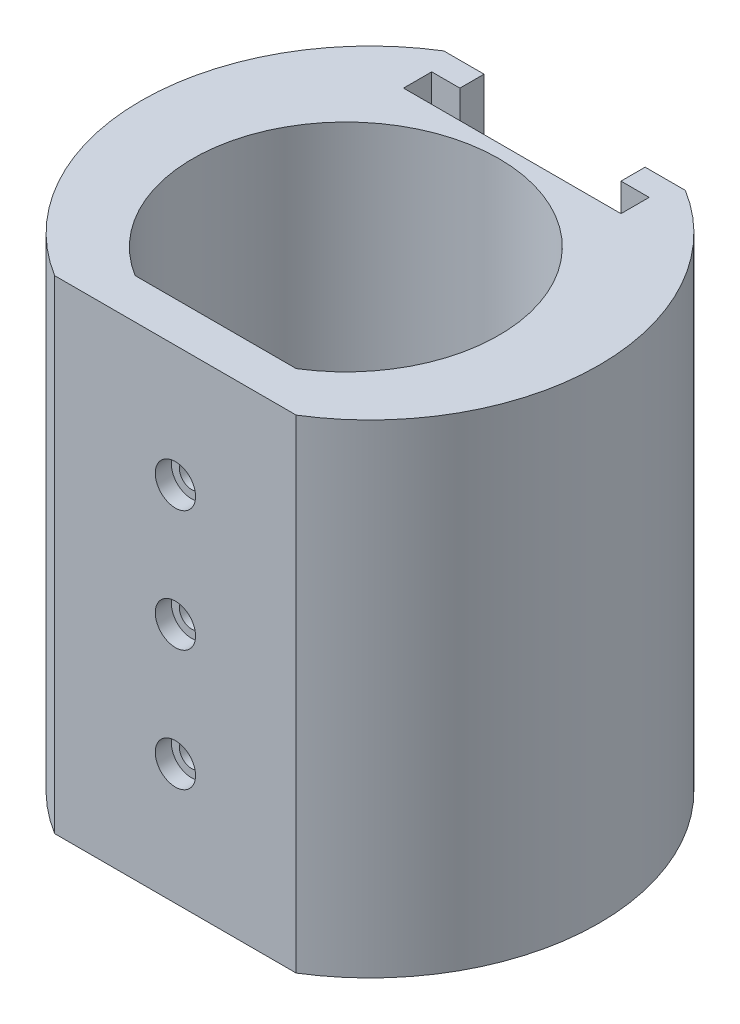
ISO-10303-21;
HEADER;
FILE_DESCRIPTION(('STEP AP214'),'2;1');
FILE_NAME('part.step','',(''),(''),'','','');
FILE_SCHEMA(('AUTOMOTIVE_DESIGN { 1 0 10303 214 1 1 1 1 }'));
ENDSEC;
DATA;
#1=APPLICATION_CONTEXT('core data for automotive mechanical design processes');
#2=APPLICATION_PROTOCOL_DEFINITION('international standard','automotive_design',2000,#1);
#3=PRODUCT_CONTEXT('',#1,'mechanical');
#4=PRODUCT('Part','Part','',(#3));
#5=PRODUCT_RELATED_PRODUCT_CATEGORY('part','',(#4));
#6=PRODUCT_DEFINITION_FORMATION('','',#4);
#7=PRODUCT_DEFINITION_CONTEXT('part definition',#1,'design');
#8=PRODUCT_DEFINITION('design','',#6,#7);
#9=PRODUCT_DEFINITION_SHAPE('','',#8);
#10=(LENGTH_UNIT() NAMED_UNIT(*) SI_UNIT(.MILLI.,.METRE.));
#11=(NAMED_UNIT(*) PLANE_ANGLE_UNIT() SI_UNIT($,.RADIAN.));
#12=(NAMED_UNIT(*) SI_UNIT($,.STERADIAN.) SOLID_ANGLE_UNIT());
#13=UNCERTAINTY_MEASURE_WITH_UNIT(LENGTH_MEASURE(1.E-05),#10,'distance_accuracy_value','');
#14=(GEOMETRIC_REPRESENTATION_CONTEXT(3) GLOBAL_UNCERTAINTY_ASSIGNED_CONTEXT((#13)) GLOBAL_UNIT_ASSIGNED_CONTEXT((#10,
#11,#12)) REPRESENTATION_CONTEXT('',''));
#15=CARTESIAN_POINT('',(0.,0.,0.));
#16=DIRECTION('',(0.,0.,1.));
#17=DIRECTION('',(1.,0.,0.));
#18=AXIS2_PLACEMENT_3D('',#15,#16,#17);
#19=CARTESIAN_POINT('',(0.,15.,19.1613744774385));
#20=DIRECTION('',(0.,0.,1.));
#21=DIRECTION('',(1.,0.,0.));
#22=AXIS2_PLACEMENT_3D('',#19,#20,#21);
#23=PLANE('',#22);
#24=CARTESIAN_POINT('',(0.,15.,19.1613744774385));
#25=DIRECTION('',(0.,0.,1.));
#26=DIRECTION('',(1.,0.,0.));
#27=AXIS2_PLACEMENT_3D('',#24,#25,#26);
#28=CIRCLE('',#27,2.5);
#29=CARTESIAN_POINT('',(2.5,15.,19.1613744774385));
#30=VERTEX_POINT('',#29);
#31=EDGE_CURVE('E211',#30,#30,#28,.T.);
#32=ORIENTED_EDGE('',*,*,#31,.T.);
#33=EDGE_LOOP('',(#32));
#34=FACE_BOUND('',#33,.T.);
#35=CARTESIAN_POINT('',(0.,15.,19.1613744774385));
#36=DIRECTION('',(0.,0.,1.));
#37=DIRECTION('',(1.,0.,0.));
#38=AXIS2_PLACEMENT_3D('',#35,#36,#37);
#39=CIRCLE('',#38,1.5);
#40=CARTESIAN_POINT('',(1.5,15.,19.1613744774385));
#41=VERTEX_POINT('',#40);
#42=EDGE_CURVE('E20',#41,#41,#39,.F.);
#43=ORIENTED_EDGE('',*,*,#42,.T.);
#44=EDGE_LOOP('',(#43));
#45=FACE_BOUND('',#44,.T.);
#46=ADVANCED_FACE('F17',(#34,#45),#23,.T.);
#47=CARTESIAN_POINT('',(0.,-15.,19.1613744774385));
#48=DIRECTION('',(0.,0.,1.));
#49=DIRECTION('',(1.,0.,0.));
#50=AXIS2_PLACEMENT_3D('',#47,#48,#49);
#51=PLANE('',#50);
#52=CARTESIAN_POINT('',(0.,-15.,19.1613744774385));
#53=DIRECTION('',(0.,0.,1.));
#54=DIRECTION('',(1.,0.,0.));
#55=AXIS2_PLACEMENT_3D('',#52,#53,#54);
#56=CIRCLE('',#55,2.5);
#57=CARTESIAN_POINT('',(2.5,-15.,19.1613744774385));
#58=VERTEX_POINT('',#57);
#59=EDGE_CURVE('E208',#58,#58,#56,.T.);
#60=ORIENTED_EDGE('',*,*,#59,.T.);
#61=EDGE_LOOP('',(#60));
#62=FACE_BOUND('',#61,.T.);
#63=CARTESIAN_POINT('',(0.,-15.,19.1613744774385));
#64=DIRECTION('',(0.,0.,1.));
#65=DIRECTION('',(1.,0.,0.));
#66=AXIS2_PLACEMENT_3D('',#63,#64,#65);
#67=CIRCLE('',#66,1.5);
#68=CARTESIAN_POINT('',(1.5,-15.,19.1613744774385));
#69=VERTEX_POINT('',#68);
#70=EDGE_CURVE('E216',#69,#69,#67,.F.);
#71=ORIENTED_EDGE('',*,*,#70,.T.);
#72=EDGE_LOOP('',(#71));
#73=FACE_BOUND('',#72,.T.);
#74=ADVANCED_FACE('F421',(#62,#73),#51,.T.);
#75=CARTESIAN_POINT('',(0.,0.,19.1613744774385));
#76=DIRECTION('',(0.,0.,1.));
#77=DIRECTION('',(1.,0.,0.));
#78=AXIS2_PLACEMENT_3D('',#75,#76,#77);
#79=PLANE('',#78);
#80=CARTESIAN_POINT('',(0.,0.,19.1613744774385));
#81=DIRECTION('',(0.,0.,1.));
#82=DIRECTION('',(1.,0.,0.));
#83=AXIS2_PLACEMENT_3D('',#80,#81,#82);
#84=CIRCLE('',#83,2.5);
#85=CARTESIAN_POINT('',(2.5,0.,19.1613744774385));
#86=VERTEX_POINT('',#85);
#87=EDGE_CURVE('E205',#86,#86,#84,.T.);
#88=ORIENTED_EDGE('',*,*,#87,.T.);
#89=EDGE_LOOP('',(#88));
#90=FACE_BOUND('',#89,.T.);
#91=CARTESIAN_POINT('',(0.,0.,19.1613744774385));
#92=DIRECTION('',(0.,0.,1.));
#93=DIRECTION('',(1.,0.,0.));
#94=AXIS2_PLACEMENT_3D('',#91,#92,#93);
#95=CIRCLE('',#94,1.5);
#96=CARTESIAN_POINT('',(1.5,0.,19.1613744774385));
#97=VERTEX_POINT('',#96);
#98=EDGE_CURVE('E214',#97,#97,#95,.F.);
#99=ORIENTED_EDGE('',*,*,#98,.T.);
#100=EDGE_LOOP('',(#99));
#101=FACE_BOUND('',#100,.T.);
#102=ADVANCED_FACE('F228',(#90,#101),#79,.T.);
#103=CARTESIAN_POINT('',(0.,15.,11.9187337903192));
#104=DIRECTION('',(0.,0.,1.));
#105=DIRECTION('',(1.,0.,0.));
#106=AXIS2_PLACEMENT_3D('',#103,#104,#105);
#107=CYLINDRICAL_SURFACE('',#106,1.5);
#108=ORIENTED_EDGE('',*,*,#42,.F.);
#109=EDGE_LOOP('',(#108));
#110=FACE_BOUND('',#109,.T.);
#111=CARTESIAN_POINT('',(0.,15.,16.1613744774385));
#112=DIRECTION('',(0.,0.,1.));
#113=DIRECTION('',(1.,0.,0.));
#114=AXIS2_PLACEMENT_3D('',#111,#112,#113);
#115=CIRCLE('',#114,1.5);
#116=CARTESIAN_POINT('',(1.5,15.,16.1613744774385));
#117=VERTEX_POINT('',#116);
#118=EDGE_CURVE('E201',#117,#117,#115,.T.);
#119=ORIENTED_EDGE('',*,*,#118,.F.);
#120=EDGE_LOOP('',(#119));
#121=FACE_BOUND('',#120,.T.);
#122=ADVANCED_FACE('F224',(#110,#121),#107,.F.);
#123=CARTESIAN_POINT('',(0.,-15.,11.9187337903192));
#124=DIRECTION('',(0.,0.,1.));
#125=DIRECTION('',(1.,0.,0.));
#126=AXIS2_PLACEMENT_3D('',#123,#124,#125);
#127=CYLINDRICAL_SURFACE('',#126,1.5);
#128=ORIENTED_EDGE('',*,*,#70,.F.);
#129=EDGE_LOOP('',(#128));
#130=FACE_BOUND('',#129,.T.);
#131=CARTESIAN_POINT('',(0.,-15.,16.1613744774385));
#132=DIRECTION('',(0.,0.,1.));
#133=DIRECTION('',(1.,0.,0.));
#134=AXIS2_PLACEMENT_3D('',#131,#132,#133);
#135=CIRCLE('',#134,1.5);
#136=CARTESIAN_POINT('',(1.5,-15.,16.1613744774385));
#137=VERTEX_POINT('',#136);
#138=EDGE_CURVE('E198',#137,#137,#135,.T.);
#139=ORIENTED_EDGE('',*,*,#138,.F.);
#140=EDGE_LOOP('',(#139));
#141=FACE_BOUND('',#140,.T.);
#142=ADVANCED_FACE('F227',(#130,#141),#127,.F.);
#143=CARTESIAN_POINT('',(0.,0.,11.9187337903192));
#144=DIRECTION('',(0.,0.,1.));
#145=DIRECTION('',(1.,0.,0.));
#146=AXIS2_PLACEMENT_3D('',#143,#144,#145);
#147=CYLINDRICAL_SURFACE('',#146,1.5);
#148=ORIENTED_EDGE('',*,*,#98,.F.);
#149=EDGE_LOOP('',(#148));
#150=FACE_BOUND('',#149,.T.);
#151=CARTESIAN_POINT('',(0.,0.,16.1613744774385));
#152=DIRECTION('',(0.,0.,1.));
#153=DIRECTION('',(1.,0.,0.));
#154=AXIS2_PLACEMENT_3D('',#151,#152,#153);
#155=CIRCLE('',#154,1.5);
#156=CARTESIAN_POINT('',(1.5,0.,16.1613744774385));
#157=VERTEX_POINT('',#156);
#158=EDGE_CURVE('E194',#157,#157,#155,.T.);
#159=ORIENTED_EDGE('',*,*,#158,.F.);
#160=EDGE_LOOP('',(#159));
#161=FACE_BOUND('',#160,.T.);
#162=ADVANCED_FACE('F412',(#150,#161),#147,.F.);
#163=CARTESIAN_POINT('',(0.,15.,19.1613744774385));
#164=DIRECTION('',(0.,0.,1.));
#165=DIRECTION('',(1.,0.,0.));
#166=AXIS2_PLACEMENT_3D('',#163,#164,#165);
#167=CYLINDRICAL_SURFACE('',#166,2.5);
#168=ORIENTED_EDGE('',*,*,#31,.F.);
#169=EDGE_LOOP('',(#168));
#170=FACE_BOUND('',#169,.T.);
#171=CARTESIAN_POINT('',(0.,15.,21.1613744774385));
#172=DIRECTION('',(0.,0.,1.));
#173=DIRECTION('',(1.,0.,0.));
#174=AXIS2_PLACEMENT_3D('',#171,#172,#173);
#175=CIRCLE('',#174,2.5);
#176=CARTESIAN_POINT('',(2.5,15.,21.1613744774385));
#177=VERTEX_POINT('',#176);
#178=EDGE_CURVE('E186',#177,#177,#175,.T.);
#179=ORIENTED_EDGE('',*,*,#178,.T.);
#180=EDGE_LOOP('',(#179));
#181=FACE_BOUND('',#180,.T.);
#182=ADVANCED_FACE('F408',(#170,#181),#167,.F.);
#183=CARTESIAN_POINT('',(0.,-15.,19.1613744774385));
#184=DIRECTION('',(0.,0.,1.));
#185=DIRECTION('',(1.,0.,0.));
#186=AXIS2_PLACEMENT_3D('',#183,#184,#185);
#187=CYLINDRICAL_SURFACE('',#186,2.5);
#188=ORIENTED_EDGE('',*,*,#59,.F.);
#189=EDGE_LOOP('',(#188));
#190=FACE_BOUND('',#189,.T.);
#191=CARTESIAN_POINT('',(0.,-15.,21.1613744774385));
#192=DIRECTION('',(0.,0.,1.));
#193=DIRECTION('',(1.,0.,0.));
#194=AXIS2_PLACEMENT_3D('',#191,#192,#193);
#195=CIRCLE('',#194,2.5);
#196=CARTESIAN_POINT('',(2.5,-15.,21.1613744774385));
#197=VERTEX_POINT('',#196);
#198=EDGE_CURVE('E183',#197,#197,#195,.T.);
#199=ORIENTED_EDGE('',*,*,#198,.T.);
#200=EDGE_LOOP('',(#199));
#201=FACE_BOUND('',#200,.T.);
#202=ADVANCED_FACE('F404',(#190,#201),#187,.F.);
#203=CARTESIAN_POINT('',(0.,0.,19.1613744774385));
#204=DIRECTION('',(0.,0.,1.));
#205=DIRECTION('',(1.,0.,0.));
#206=AXIS2_PLACEMENT_3D('',#203,#204,#205);
#207=CYLINDRICAL_SURFACE('',#206,2.5);
#208=ORIENTED_EDGE('',*,*,#87,.F.);
#209=EDGE_LOOP('',(#208));
#210=FACE_BOUND('',#209,.T.);
#211=CARTESIAN_POINT('',(0.,0.,21.1613744774385));
#212=DIRECTION('',(0.,0.,1.));
#213=DIRECTION('',(1.,0.,0.));
#214=AXIS2_PLACEMENT_3D('',#211,#212,#213);
#215=CIRCLE('',#214,2.5);
#216=CARTESIAN_POINT('',(2.5,0.,21.1613744774385));
#217=VERTEX_POINT('',#216);
#218=EDGE_CURVE('E180',#217,#217,#215,.T.);
#219=ORIENTED_EDGE('',*,*,#218,.T.);
#220=EDGE_LOOP('',(#219));
#221=FACE_BOUND('',#220,.T.);
#222=ADVANCED_FACE('F398',(#210,#221),#207,.F.);
#223=CARTESIAN_POINT('',(13.5,-57.7713881539976,-24.1613744774385));
#224=DIRECTION('',(0.,0.,-1.));
#225=DIRECTION('',(-1.,0.,0.));
#226=AXIS2_PLACEMENT_3D('',#223,#224,#225);
#227=PLANE('',#226);
#228=DIRECTION('',(0.,1.,0.));
#229=VECTOR('',#228,1.);
#230=CARTESIAN_POINT('',(13.5,-57.7713881539976,-24.1613744774385));
#231=LINE('',#230,#229);
#232=CARTESIAN_POINT('',(13.5,-20.,-24.1613744774385));
#233=VERTEX_POINT('',#232);
#234=CARTESIAN_POINT('',(13.5,30.,-24.1613744774385));
#235=VERTEX_POINT('',#234);
#236=EDGE_CURVE('E118',#233,#235,#231,.T.);
#237=ORIENTED_EDGE('',*,*,#236,.T.);
#238=DIRECTION('',(1.,0.,0.));
#239=VECTOR('',#238,1.);
#240=CARTESIAN_POINT('',(0.,30.,-24.1613744774385));
#241=LINE('',#240,#239);
#242=CARTESIAN_POINT('',(10.,30.,-24.1613744774385));
#243=VERTEX_POINT('',#242);
#244=EDGE_CURVE('E126',#243,#235,#241,.T.);
#245=ORIENTED_EDGE('',*,*,#244,.F.);
#246=DIRECTION('',(0.,1.,0.));
#247=VECTOR('',#246,1.);
#248=CARTESIAN_POINT('',(10.,-57.7713881539976,-24.1613744774385));
#249=LINE('',#248,#247);
#250=CARTESIAN_POINT('',(10.,-20.,-24.1613744774385));
#251=VERTEX_POINT('',#250);
#252=EDGE_CURVE('E84',#243,#251,#249,.F.);
#253=ORIENTED_EDGE('',*,*,#252,.T.);
#254=DIRECTION('',(1.,0.,0.));
#255=VECTOR('',#254,1.);
#256=CARTESIAN_POINT('',(0.,-20.,-24.1613744774385));
#257=LINE('',#256,#255);
#258=EDGE_CURVE('E123',#233,#251,#257,.F.);
#259=ORIENTED_EDGE('',*,*,#258,.F.);
#260=EDGE_LOOP('',(#237,#245,#253,#259));
#261=FACE_BOUND('',#260,.T.);
#262=ADVANCED_FACE('F121',(#261),#227,.F.);
#263=CARTESIAN_POINT('',(13.5,-57.7713881539976,-20.6613744774385));
#264=DIRECTION('',(1.,0.,0.));
#265=DIRECTION('',(0.,0.,-1.));
#266=AXIS2_PLACEMENT_3D('',#263,#264,#265);
#267=PLANE('',#266);
#268=DIRECTION('',(0.,1.,0.));
#269=VECTOR('',#268,1.);
#270=CARTESIAN_POINT('',(13.5,-57.7713881539976,-20.6613744774385));
#271=LINE('',#270,#269);
#272=CARTESIAN_POINT('',(13.5,-20.,-20.6613744774385));
#273=VERTEX_POINT('',#272);
#274=CARTESIAN_POINT('',(13.5,30.,-20.6613744774385));
#275=VERTEX_POINT('',#274);
#276=EDGE_CURVE('E356',#273,#275,#271,.T.);
#277=ORIENTED_EDGE('',*,*,#276,.T.);
#278=DIRECTION('',(0.,0.,1.));
#279=VECTOR('',#278,1.);
#280=CARTESIAN_POINT('',(13.5,30.,-3.));
#281=LINE('',#280,#279);
#282=EDGE_CURVE('E361',#235,#275,#281,.T.);
#283=ORIENTED_EDGE('',*,*,#282,.F.);
#284=ORIENTED_EDGE('',*,*,#236,.F.);
#285=DIRECTION('',(0.,0.,1.));
#286=VECTOR('',#285,1.);
#287=CARTESIAN_POINT('',(13.5,-20.,-3.));
#288=LINE('',#287,#286);
#289=EDGE_CURVE('E144',#273,#233,#288,.F.);
#290=ORIENTED_EDGE('',*,*,#289,.F.);
#291=EDGE_LOOP('',(#277,#283,#284,#290));
#292=FACE_BOUND('',#291,.T.);
#293=ADVANCED_FACE('F390',(#292),#267,.F.);
#294=CARTESIAN_POINT('',(-13.5,-57.7713881539976,-20.6613744774385));
#295=DIRECTION('',(0.,0.,1.));
#296=DIRECTION('',(1.,0.,0.));
#297=AXIS2_PLACEMENT_3D('',#294,#295,#296);
#298=PLANE('',#297);
#299=DIRECTION('',(0.,1.,0.));
#300=VECTOR('',#299,1.);
#301=CARTESIAN_POINT('',(-13.5,-57.7713881539976,-20.6613744774385));
#302=LINE('',#301,#300);
#303=CARTESIAN_POINT('',(-13.5,-20.,-20.6613744774385));
#304=VERTEX_POINT('',#303);
#305=CARTESIAN_POINT('',(-13.5,30.,-20.6613744774385));
#306=VERTEX_POINT('',#305);
#307=EDGE_CURVE('E348',#304,#306,#302,.T.);
#308=ORIENTED_EDGE('',*,*,#307,.T.);
#309=DIRECTION('',(1.,0.,0.));
#310=VECTOR('',#309,1.);
#311=CARTESIAN_POINT('',(0.,30.,-20.6613744774385));
#312=LINE('',#311,#310);
#313=EDGE_CURVE('E352',#275,#306,#312,.F.);
#314=ORIENTED_EDGE('',*,*,#313,.F.);
#315=ORIENTED_EDGE('',*,*,#276,.F.);
#316=DIRECTION('',(1.,0.,0.));
#317=VECTOR('',#316,1.);
#318=CARTESIAN_POINT('',(0.,-20.,-20.6613744774385));
#319=LINE('',#318,#317);
#320=EDGE_CURVE('E146',#304,#273,#319,.T.);
#321=ORIENTED_EDGE('',*,*,#320,.F.);
#322=EDGE_LOOP('',(#308,#314,#315,#321));
#323=FACE_BOUND('',#322,.T.);
#324=ADVANCED_FACE('F389',(#323),#298,.F.);
#325=CARTESIAN_POINT('',(-13.5,-57.7713881539976,-24.1613744774385));
#326=DIRECTION('',(-1.,0.,0.));
#327=DIRECTION('',(0.,0.,1.));
#328=AXIS2_PLACEMENT_3D('',#325,#326,#327);
#329=PLANE('',#328);
#330=DIRECTION('',(0.,1.,0.));
#331=VECTOR('',#330,1.);
#332=CARTESIAN_POINT('',(-13.5,-57.7713881539976,-24.1613744774385));
#333=LINE('',#332,#331);
#334=CARTESIAN_POINT('',(-13.5,-20.,-24.1613744774385));
#335=VERTEX_POINT('',#334);
#336=CARTESIAN_POINT('',(-13.5,30.,-24.1613744774385));
#337=VERTEX_POINT('',#336);
#338=EDGE_CURVE('E204',#335,#337,#333,.T.);
#339=ORIENTED_EDGE('',*,*,#338,.T.);
#340=DIRECTION('',(0.,0.,1.));
#341=VECTOR('',#340,1.);
#342=CARTESIAN_POINT('',(-13.5,30.,-3.));
#343=LINE('',#342,#341);
#344=EDGE_CURVE('E344',#306,#337,#343,.F.);
#345=ORIENTED_EDGE('',*,*,#344,.F.);
#346=ORIENTED_EDGE('',*,*,#307,.F.);
#347=DIRECTION('',(0.,0.,1.));
#348=VECTOR('',#347,1.);
#349=CARTESIAN_POINT('',(-13.5,-20.,-3.));
#350=LINE('',#349,#348);
#351=EDGE_CURVE('E153',#335,#304,#350,.T.);
#352=ORIENTED_EDGE('',*,*,#351,.F.);
#353=EDGE_LOOP('',(#339,#345,#346,#352));
#354=FACE_BOUND('',#353,.T.);
#355=ADVANCED_FACE('F246',(#354),#329,.F.);
#356=CARTESIAN_POINT('',(-10.,-57.7713881539976,-24.1613744774385));
#357=DIRECTION('',(0.,0.,-1.));
#358=DIRECTION('',(-1.,0.,0.));
#359=AXIS2_PLACEMENT_3D('',#356,#357,#358);
#360=PLANE('',#359);
#361=DIRECTION('',(0.,1.,0.));
#362=VECTOR('',#361,1.);
#363=CARTESIAN_POINT('',(-10.,-57.7713881539976,-24.1613744774385));
#364=LINE('',#363,#362);
#365=CARTESIAN_POINT('',(-10.,-20.,-24.1613744774385));
#366=VERTEX_POINT('',#365);
#367=CARTESIAN_POINT('',(-10.,30.,-24.1613744774385));
#368=VERTEX_POINT('',#367);
#369=EDGE_CURVE('E129',#366,#368,#364,.T.);
#370=ORIENTED_EDGE('',*,*,#369,.T.);
#371=DIRECTION('',(1.,0.,0.));
#372=VECTOR('',#371,1.);
#373=CARTESIAN_POINT('',(0.,30.,-24.1613744774385));
#374=LINE('',#373,#372);
#375=EDGE_CURVE('E296',#337,#368,#374,.T.);
#376=ORIENTED_EDGE('',*,*,#375,.F.);
#377=ORIENTED_EDGE('',*,*,#338,.F.);
#378=DIRECTION('',(1.,0.,0.));
#379=VECTOR('',#378,1.);
#380=CARTESIAN_POINT('',(0.,-20.,-24.1613744774385));
#381=LINE('',#380,#379);
#382=EDGE_CURVE('E156',#366,#335,#381,.F.);
#383=ORIENTED_EDGE('',*,*,#382,.F.);
#384=EDGE_LOOP('',(#370,#376,#377,#383));
#385=FACE_BOUND('',#384,.T.);
#386=ADVANCED_FACE('F235',(#385),#360,.F.);
#387=CARTESIAN_POINT('',(-10.,30.,16.1613744774385));
#388=DIRECTION('',(0.,0.,-1.));
#389=DIRECTION('',(-1.,0.,0.));
#390=AXIS2_PLACEMENT_3D('',#387,#388,#389);
#391=PLANE('',#390);
#392=DIRECTION('',(1.,0.,0.));
#393=VECTOR('',#392,1.);
#394=CARTESIAN_POINT('',(0.,30.,16.1613744774385));
#395=LINE('',#394,#393);
#396=CARTESIAN_POINT('',(10.,30.,16.1613744774385));
#397=VERTEX_POINT('',#396);
#398=CARTESIAN_POINT('',(-10.,30.,16.1613744774385));
#399=VERTEX_POINT('',#398);
#400=EDGE_CURVE('E175',#397,#399,#395,.F.);
#401=ORIENTED_EDGE('',*,*,#400,.F.);
#402=DIRECTION('',(0.,-1.,0.));
#403=VECTOR('',#402,1.);
#404=CARTESIAN_POINT('',(10.,30.,16.1613744774385));
#405=LINE('',#404,#403);
#406=CARTESIAN_POINT('',(10.,-30.,16.1613744774385));
#407=VERTEX_POINT('',#406);
#408=EDGE_CURVE('E335',#397,#407,#405,.T.);
#409=ORIENTED_EDGE('',*,*,#408,.T.);
#410=DIRECTION('',(1.,0.,0.));
#411=VECTOR('',#410,1.);
#412=CARTESIAN_POINT('',(0.,-30.,16.1613744774385));
#413=LINE('',#412,#411);
#414=CARTESIAN_POINT('',(-10.,-30.,16.1613744774385));
#415=VERTEX_POINT('',#414);
#416=EDGE_CURVE('E192',#407,#415,#413,.F.);
#417=ORIENTED_EDGE('',*,*,#416,.T.);
#418=DIRECTION('',(0.,-1.,0.));
#419=VECTOR('',#418,1.);
#420=CARTESIAN_POINT('',(-10.,30.,16.1613744774385));
#421=LINE('',#420,#419);
#422=EDGE_CURVE('E197',#415,#399,#421,.F.);
#423=ORIENTED_EDGE('',*,*,#422,.T.);
#424=EDGE_LOOP('',(#401,#409,#417,#423));
#425=FACE_BOUND('',#424,.T.);
#426=ORIENTED_EDGE('',*,*,#158,.T.);
#427=EDGE_LOOP('',(#426));
#428=FACE_BOUND('',#427,.T.);
#429=ORIENTED_EDGE('',*,*,#138,.T.);
#430=EDGE_LOOP('',(#429));
#431=FACE_BOUND('',#430,.T.);
#432=ORIENTED_EDGE('',*,*,#118,.T.);
#433=EDGE_LOOP('',(#432));
#434=FACE_BOUND('',#433,.T.);
#435=ADVANCED_FACE('F232',(#425,#428,#431,#434),#391,.T.);
#436=CARTESIAN_POINT('',(0.,30.,0.));
#437=DIRECTION('',(0.,-1.,0.));
#438=DIRECTION('',(0.,0.,-1.));
#439=AXIS2_PLACEMENT_3D('',#436,#437,#438);
#440=CYLINDRICAL_SURFACE('',#439,19.005);
#441=CARTESIAN_POINT('',(0.,30.,0.));
#442=DIRECTION('',(0.,-1.,0.));
#443=DIRECTION('',(0.,0.,-1.));
#444=AXIS2_PLACEMENT_3D('',#441,#442,#443);
#445=CIRCLE('',#444,19.005);
#446=EDGE_CURVE('E171',#399,#397,#445,.T.);
#447=ORIENTED_EDGE('',*,*,#446,.F.);
#448=ORIENTED_EDGE('',*,*,#422,.F.);
#449=CARTESIAN_POINT('',(0.,-30.,0.));
#450=DIRECTION('',(0.,-1.,0.));
#451=DIRECTION('',(0.,0.,-1.));
#452=AXIS2_PLACEMENT_3D('',#449,#450,#451);
#453=CIRCLE('',#452,19.005);
#454=EDGE_CURVE('E189',#415,#407,#453,.T.);
#455=ORIENTED_EDGE('',*,*,#454,.T.);
#456=ORIENTED_EDGE('',*,*,#408,.F.);
#457=EDGE_LOOP('',(#447,#448,#455,#456));
#458=FACE_BOUND('',#457,.T.);
#459=ADVANCED_FACE('F234',(#458),#440,.F.);
#460=CARTESIAN_POINT('',(-10.,-57.7713881539976,-27.1613744774385));
#461=DIRECTION('',(-1.,0.,0.));
#462=DIRECTION('',(0.,0.,1.));
#463=AXIS2_PLACEMENT_3D('',#460,#461,#462);
#464=PLANE('',#463);
#465=DIRECTION('',(0.,1.,0.));
#466=VECTOR('',#465,1.);
#467=CARTESIAN_POINT('',(-10.,30.,-27.1613744774385));
#468=LINE('',#467,#466);
#469=CARTESIAN_POINT('',(-10.,-20.,-27.1613744774385));
#470=VERTEX_POINT('',#469);
#471=CARTESIAN_POINT('',(-10.,30.,-27.1613744774385));
#472=VERTEX_POINT('',#471);
#473=EDGE_CURVE('E174',#470,#472,#468,.T.);
#474=ORIENTED_EDGE('',*,*,#473,.T.);
#475=DIRECTION('',(0.,0.,1.));
#476=VECTOR('',#475,1.);
#477=CARTESIAN_POINT('',(-10.,30.,-3.));
#478=LINE('',#477,#476);
#479=EDGE_CURVE('E289',#368,#472,#478,.F.);
#480=ORIENTED_EDGE('',*,*,#479,.F.);
#481=ORIENTED_EDGE('',*,*,#369,.F.);
#482=DIRECTION('',(0.,0.,1.));
#483=VECTOR('',#482,1.);
#484=CARTESIAN_POINT('',(-10.,-20.,-3.));
#485=LINE('',#484,#483);
#486=EDGE_CURVE('E128',#470,#366,#485,.T.);
#487=ORIENTED_EDGE('',*,*,#486,.F.);
#488=EDGE_LOOP('',(#474,#480,#481,#487));
#489=FACE_BOUND('',#488,.T.);
#490=ADVANCED_FACE('F243',(#489),#464,.F.);
#491=CARTESIAN_POINT('',(0.,30.,-3.));
#492=DIRECTION('',(0.,-1.,0.));
#493=DIRECTION('',(0.,0.,-1.));
#494=AXIS2_PLACEMENT_3D('',#491,#492,#493);
#495=CYLINDRICAL_SURFACE('',#494,28.4389172902032);
#496=CARTESIAN_POINT('',(0.,30.,-3.));
#497=DIRECTION('',(0.,-1.,0.));
#498=DIRECTION('',(0.,0.,-1.));
#499=AXIS2_PLACEMENT_3D('',#496,#497,#498);
#500=CIRCLE('',#499,28.4389172902032);
#501=CARTESIAN_POINT('',(15.,30.,21.1613744774385));
#502=VERTEX_POINT('',#501);
#503=CARTESIAN_POINT('',(15.,30.,-27.1613744774385));
#504=VERTEX_POINT('',#503);
#505=EDGE_CURVE('E176',#502,#504,#500,.F.);
#506=ORIENTED_EDGE('',*,*,#505,.F.);
#507=DIRECTION('',(0.,1.,0.));
#508=VECTOR('',#507,1.);
#509=CARTESIAN_POINT('',(15.,30.,21.1613744774385));
#510=LINE('',#509,#508);
#511=CARTESIAN_POINT('',(15.,-30.,21.1613744774385));
#512=VERTEX_POINT('',#511);
#513=EDGE_CURVE('E75',#502,#512,#510,.F.);
#514=ORIENTED_EDGE('',*,*,#513,.T.);
#515=CARTESIAN_POINT('',(0.,-30.,-3.));
#516=DIRECTION('',(0.,-1.,0.));
#517=DIRECTION('',(0.,0.,-1.));
#518=AXIS2_PLACEMENT_3D('',#515,#516,#517);
#519=CIRCLE('',#518,28.4389172902032);
#520=CARTESIAN_POINT('',(15.,-30.,-27.1613744774385));
#521=VERTEX_POINT('',#520);
#522=EDGE_CURVE('E140',#512,#521,#519,.F.);
#523=ORIENTED_EDGE('',*,*,#522,.T.);
#524=DIRECTION('',(0.,1.,0.));
#525=VECTOR('',#524,1.);
#526=CARTESIAN_POINT('',(15.,30.,-27.1613744774385));
#527=LINE('',#526,#525);
#528=EDGE_CURVE('E302',#521,#504,#527,.T.);
#529=ORIENTED_EDGE('',*,*,#528,.T.);
#530=EDGE_LOOP('',(#506,#514,#523,#529));
#531=FACE_BOUND('',#530,.T.);
#532=ADVANCED_FACE('F277',(#531),#495,.T.);
#533=CARTESIAN_POINT('',(10.,-57.7713881539976,-24.1613744774385));
#534=DIRECTION('',(1.,0.,0.));
#535=DIRECTION('',(0.,0.,-1.));
#536=AXIS2_PLACEMENT_3D('',#533,#534,#535);
#537=PLANE('',#536);
#538=ORIENTED_EDGE('',*,*,#252,.F.);
#539=DIRECTION('',(0.,0.,1.));
#540=VECTOR('',#539,1.);
#541=CARTESIAN_POINT('',(10.,30.,-3.));
#542=LINE('',#541,#540);
#543=CARTESIAN_POINT('',(10.,30.,-27.1613744774385));
#544=VERTEX_POINT('',#543);
#545=EDGE_CURVE('E310',#544,#243,#542,.T.);
#546=ORIENTED_EDGE('',*,*,#545,.F.);
#547=DIRECTION('',(0.,1.,0.));
#548=VECTOR('',#547,1.);
#549=CARTESIAN_POINT('',(10.,30.,-27.1613744774385));
#550=LINE('',#549,#548);
#551=CARTESIAN_POINT('',(10.,-20.,-27.1613744774385));
#552=VERTEX_POINT('',#551);
#553=EDGE_CURVE('E136',#544,#552,#550,.F.);
#554=ORIENTED_EDGE('',*,*,#553,.T.);
#555=DIRECTION('',(0.,0.,1.));
#556=VECTOR('',#555,1.);
#557=CARTESIAN_POINT('',(10.,-20.,-3.));
#558=LINE('',#557,#556);
#559=EDGE_CURVE('E133',#251,#552,#558,.F.);
#560=ORIENTED_EDGE('',*,*,#559,.F.);
#561=EDGE_LOOP('',(#538,#546,#554,#560));
#562=FACE_BOUND('',#561,.T.);
#563=ADVANCED_FACE('F134',(#562),#537,.F.);
#564=CARTESIAN_POINT('',(0.,-20.,-3.));
#565=DIRECTION('',(0.,1.,0.));
#566=DIRECTION('',(0.,0.,1.));
#567=AXIS2_PLACEMENT_3D('',#564,#565,#566);
#568=PLANE('',#567);
#569=ORIENTED_EDGE('',*,*,#258,.T.);
#570=ORIENTED_EDGE('',*,*,#559,.T.);
#571=DIRECTION('',(1.,0.,0.));
#572=VECTOR('',#571,1.);
#573=CARTESIAN_POINT('',(-15.,-20.,-27.1613744774385));
#574=LINE('',#573,#572);
#575=EDGE_CURVE('E170',#552,#470,#574,.F.);
#576=ORIENTED_EDGE('',*,*,#575,.T.);
#577=ORIENTED_EDGE('',*,*,#486,.T.);
#578=ORIENTED_EDGE('',*,*,#382,.T.);
#579=ORIENTED_EDGE('',*,*,#351,.T.);
#580=ORIENTED_EDGE('',*,*,#320,.T.);
#581=ORIENTED_EDGE('',*,*,#289,.T.);
#582=EDGE_LOOP('',(#569,#570,#576,#577,#578,#579,#580,#581));
#583=FACE_BOUND('',#582,.T.);
#584=ADVANCED_FACE('F142',(#583),#568,.T.);
#585=CARTESIAN_POINT('',(0.,-30.,-3.));
#586=DIRECTION('',(0.,1.,0.));
#587=DIRECTION('',(0.,0.,1.));
#588=AXIS2_PLACEMENT_3D('',#585,#586,#587);
#589=PLANE('',#588);
#590=ORIENTED_EDGE('',*,*,#454,.F.);
#591=ORIENTED_EDGE('',*,*,#416,.F.);
#592=EDGE_LOOP('',(#590,#591));
#593=FACE_BOUND('',#592,.T.);
#594=DIRECTION('',(1.,0.,0.));
#595=VECTOR('',#594,1.);
#596=CARTESIAN_POINT('',(-15.,-30.,-27.1613744774385));
#597=LINE('',#596,#595);
#598=CARTESIAN_POINT('',(-15.,-30.,-27.1613744774385));
#599=VERTEX_POINT('',#598);
#600=EDGE_CURVE('E299',#599,#521,#597,.T.);
#601=ORIENTED_EDGE('',*,*,#600,.T.);
#602=ORIENTED_EDGE('',*,*,#522,.F.);
#603=DIRECTION('',(-1.,0.,0.));
#604=VECTOR('',#603,1.);
#605=CARTESIAN_POINT('',(-15.,-30.,21.1613744774385));
#606=LINE('',#605,#604);
#607=CARTESIAN_POINT('',(-15.,-30.,21.1613744774385));
#608=VERTEX_POINT('',#607);
#609=EDGE_CURVE('E308',#512,#608,#606,.T.);
#610=ORIENTED_EDGE('',*,*,#609,.T.);
#611=CARTESIAN_POINT('',(0.,-30.,-3.));
#612=DIRECTION('',(0.,-1.,0.));
#613=DIRECTION('',(0.,0.,-1.));
#614=AXIS2_PLACEMENT_3D('',#611,#612,#613);
#615=CIRCLE('',#614,28.4389172902032);
#616=EDGE_CURVE('E167',#599,#608,#615,.F.);
#617=ORIENTED_EDGE('',*,*,#616,.F.);
#618=EDGE_LOOP('',(#601,#602,#610,#617));
#619=FACE_BOUND('',#618,.T.);
#620=ADVANCED_FACE('F268',(#593,#619),#589,.F.);
#621=CARTESIAN_POINT('',(-15.,30.,21.1613744774385));
#622=DIRECTION('',(0.,0.,-1.));
#623=DIRECTION('',(-1.,0.,0.));
#624=AXIS2_PLACEMENT_3D('',#621,#622,#623);
#625=PLANE('',#624);
#626=ORIENTED_EDGE('',*,*,#513,.F.);
#627=DIRECTION('',(1.,0.,0.));
#628=VECTOR('',#627,1.);
#629=CARTESIAN_POINT('',(0.,30.,21.1613744774385));
#630=LINE('',#629,#628);
#631=CARTESIAN_POINT('',(-15.,30.,21.1613744774385));
#632=VERTEX_POINT('',#631);
#633=EDGE_CURVE('E179',#632,#502,#630,.T.);
#634=ORIENTED_EDGE('',*,*,#633,.F.);
#635=DIRECTION('',(0.,-1.,0.));
#636=VECTOR('',#635,1.);
#637=CARTESIAN_POINT('',(-15.,30.,21.1613744774385));
#638=LINE('',#637,#636);
#639=EDGE_CURVE('E166',#608,#632,#638,.F.);
#640=ORIENTED_EDGE('',*,*,#639,.F.);
#641=ORIENTED_EDGE('',*,*,#609,.F.);
#642=EDGE_LOOP('',(#626,#634,#640,#641));
#643=FACE_BOUND('',#642,.T.);
#644=ORIENTED_EDGE('',*,*,#218,.F.);
#645=EDGE_LOOP('',(#644));
#646=FACE_BOUND('',#645,.T.);
#647=ORIENTED_EDGE('',*,*,#198,.F.);
#648=EDGE_LOOP('',(#647));
#649=FACE_BOUND('',#648,.T.);
#650=ORIENTED_EDGE('',*,*,#178,.F.);
#651=EDGE_LOOP('',(#650));
#652=FACE_BOUND('',#651,.T.);
#653=ADVANCED_FACE('F264',(#643,#646,#649,#652),#625,.F.);
#654=CARTESIAN_POINT('',(0.,30.,-3.));
#655=DIRECTION('',(0.,1.,0.));
#656=DIRECTION('',(0.,0.,1.));
#657=AXIS2_PLACEMENT_3D('',#654,#655,#656);
#658=PLANE('',#657);
#659=ORIENTED_EDGE('',*,*,#400,.T.);
#660=ORIENTED_EDGE('',*,*,#446,.T.);
#661=EDGE_LOOP('',(#659,#660));
#662=FACE_BOUND('',#661,.T.);
#663=ORIENTED_EDGE('',*,*,#505,.T.);
#664=DIRECTION('',(1.,0.,0.));
#665=VECTOR('',#664,1.);
#666=CARTESIAN_POINT('',(-15.,30.,-27.1613744774385));
#667=LINE('',#666,#665);
#668=EDGE_CURVE('E314',#504,#544,#667,.F.);
#669=ORIENTED_EDGE('',*,*,#668,.T.);
#670=ORIENTED_EDGE('',*,*,#545,.T.);
#671=ORIENTED_EDGE('',*,*,#244,.T.);
#672=ORIENTED_EDGE('',*,*,#282,.T.);
#673=ORIENTED_EDGE('',*,*,#313,.T.);
#674=ORIENTED_EDGE('',*,*,#344,.T.);
#675=ORIENTED_EDGE('',*,*,#375,.T.);
#676=ORIENTED_EDGE('',*,*,#479,.T.);
#677=DIRECTION('',(1.,0.,0.));
#678=VECTOR('',#677,1.);
#679=CARTESIAN_POINT('',(-15.,30.,-27.1613744774385));
#680=LINE('',#679,#678);
#681=CARTESIAN_POINT('',(-15.,30.,-27.1613744774385));
#682=VERTEX_POINT('',#681);
#683=EDGE_CURVE('E35',#472,#682,#680,.F.);
#684=ORIENTED_EDGE('',*,*,#683,.T.);
#685=CARTESIAN_POINT('',(0.,30.,-3.));
#686=DIRECTION('',(0.,-1.,0.));
#687=DIRECTION('',(0.,0.,-1.));
#688=AXIS2_PLACEMENT_3D('',#685,#686,#687);
#689=CIRCLE('',#688,28.4389172902032);
#690=EDGE_CURVE('E26',#632,#682,#689,.T.);
#691=ORIENTED_EDGE('',*,*,#690,.F.);
#692=ORIENTED_EDGE('',*,*,#633,.T.);
#693=EDGE_LOOP('',(#663,#669,#670,#671,#672,#673,#674,#675,#676,#684,#691,#692));
#694=FACE_BOUND('',#693,.T.);
#695=ADVANCED_FACE('F258',(#662,#694),#658,.T.);
#696=CARTESIAN_POINT('',(-15.,30.,-27.1613744774385));
#697=DIRECTION('',(0.,0.,1.));
#698=DIRECTION('',(1.,0.,0.));
#699=AXIS2_PLACEMENT_3D('',#696,#697,#698);
#700=PLANE('',#699);
#701=ORIENTED_EDGE('',*,*,#553,.F.);
#702=ORIENTED_EDGE('',*,*,#668,.F.);
#703=ORIENTED_EDGE('',*,*,#528,.F.);
#704=ORIENTED_EDGE('',*,*,#600,.F.);
#705=DIRECTION('',(0.,-1.,0.));
#706=VECTOR('',#705,1.);
#707=CARTESIAN_POINT('',(-15.,30.,-27.1613744774385));
#708=LINE('',#707,#706);
#709=EDGE_CURVE('E11',#682,#599,#708,.T.);
#710=ORIENTED_EDGE('',*,*,#709,.F.);
#711=ORIENTED_EDGE('',*,*,#683,.F.);
#712=ORIENTED_EDGE('',*,*,#473,.F.);
#713=ORIENTED_EDGE('',*,*,#575,.F.);
#714=EDGE_LOOP('',(#701,#702,#703,#704,#710,#711,#712,#713));
#715=FACE_BOUND('',#714,.T.);
#716=ADVANCED_FACE('F252',(#715),#700,.F.);
#717=CARTESIAN_POINT('',(0.,30.,-3.));
#718=DIRECTION('',(0.,-1.,0.));
#719=DIRECTION('',(0.,0.,-1.));
#720=AXIS2_PLACEMENT_3D('',#717,#718,#719);
#721=CYLINDRICAL_SURFACE('',#720,28.4389172902032);
#722=ORIENTED_EDGE('',*,*,#690,.T.);
#723=ORIENTED_EDGE('',*,*,#709,.T.);
#724=ORIENTED_EDGE('',*,*,#616,.T.);
#725=ORIENTED_EDGE('',*,*,#639,.T.);
#726=EDGE_LOOP('',(#722,#723,#724,#725));
#727=FACE_BOUND('',#726,.T.);
#728=ADVANCED_FACE('F250',(#727),#721,.T.);
#729=CLOSED_SHELL('',(#46,#74,#102,#122,#142,#162,#182,#202,#222,#262,#293,#324,#355,#386,#435,
#459,#490,#532,#563,#584,#620,#653,#695,#716,#728));
#730=MANIFOLD_SOLID_BREP('B1',#729);
#731=ADVANCED_BREP_SHAPE_REPRESENTATION('',(#18,#730),#14);
#732=SHAPE_DEFINITION_REPRESENTATION(#9,#731);
ENDSEC;
END-ISO-10303-21;
